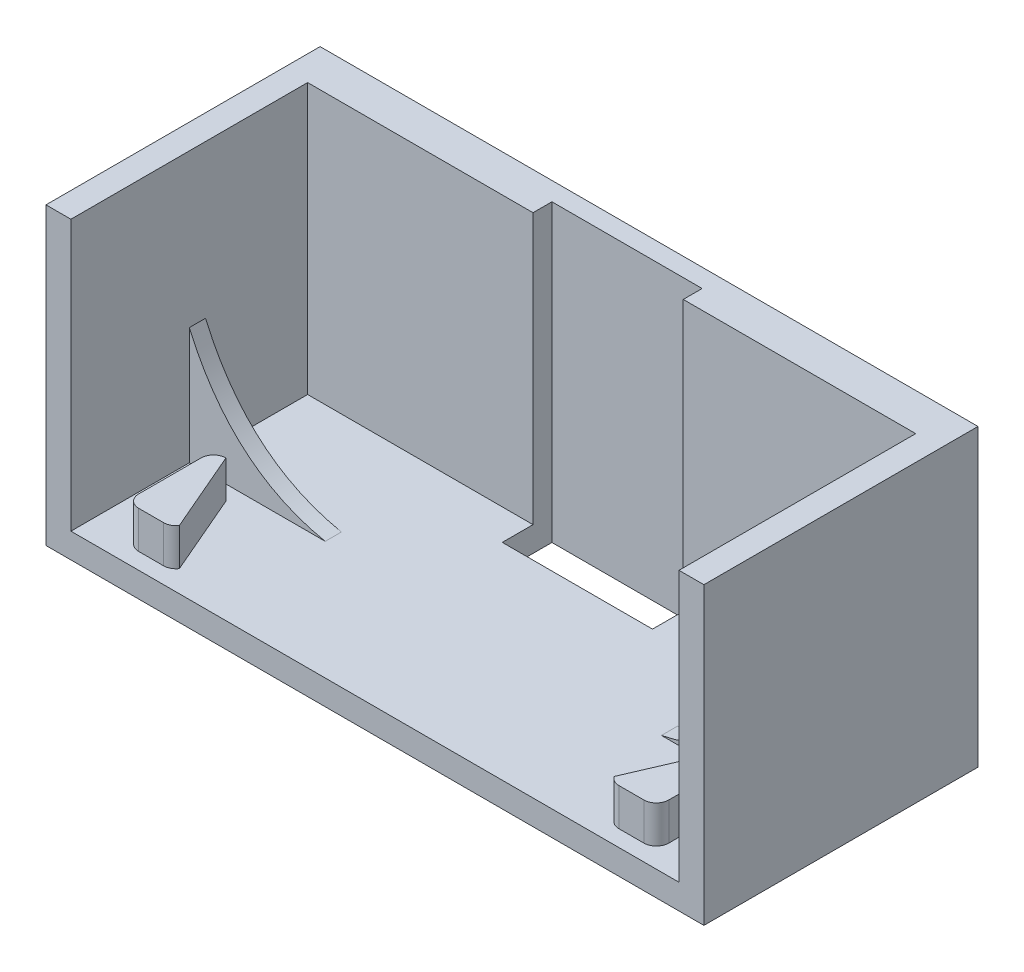
ISO-10303-21;
HEADER;
FILE_DESCRIPTION(('STEP AP214'),'2;1');
FILE_NAME('part.step','',(''),(''),'','','');
FILE_SCHEMA(('AUTOMOTIVE_DESIGN { 1 0 10303 214 1 1 1 1 }'));
ENDSEC;
DATA;
#1=APPLICATION_CONTEXT('core data for automotive mechanical design processes');
#2=APPLICATION_PROTOCOL_DEFINITION('international standard','automotive_design',2000,#1);
#3=PRODUCT_CONTEXT('',#1,'mechanical');
#4=PRODUCT('Part','Part','',(#3));
#5=PRODUCT_RELATED_PRODUCT_CATEGORY('part','',(#4));
#6=PRODUCT_DEFINITION_FORMATION('','',#4);
#7=PRODUCT_DEFINITION_CONTEXT('part definition',#1,'design');
#8=PRODUCT_DEFINITION('design','',#6,#7);
#9=PRODUCT_DEFINITION_SHAPE('','',#8);
#10=(LENGTH_UNIT() NAMED_UNIT(*) SI_UNIT(.MILLI.,.METRE.));
#11=(NAMED_UNIT(*) PLANE_ANGLE_UNIT() SI_UNIT($,.RADIAN.));
#12=(NAMED_UNIT(*) SI_UNIT($,.STERADIAN.) SOLID_ANGLE_UNIT());
#13=UNCERTAINTY_MEASURE_WITH_UNIT(LENGTH_MEASURE(1.E-05),#10,'distance_accuracy_value','');
#14=(GEOMETRIC_REPRESENTATION_CONTEXT(3) GLOBAL_UNCERTAINTY_ASSIGNED_CONTEXT((#13)) GLOBAL_UNIT_ASSIGNED_CONTEXT((#10,
#11,#12)) REPRESENTATION_CONTEXT('',''));
#15=CARTESIAN_POINT('',(0.,0.,0.));
#16=DIRECTION('',(0.,0.,1.));
#17=DIRECTION('',(1.,0.,0.));
#18=AXIS2_PLACEMENT_3D('',#15,#16,#17);
#19=CARTESIAN_POINT('',(-24.404047634165,-1.28478141343808,-19.));
#20=DIRECTION('',(0.,1.,0.));
#21=DIRECTION('',(0.,0.,1.));
#22=AXIS2_PLACEMENT_3D('',#19,#20,#21);
#23=PLANE('',#22);
#24=DIRECTION('',(-1.,0.,0.));
#25=VECTOR('',#24,1.);
#26=CARTESIAN_POINT('',(-24.404047634165,-1.28478141343808,-10.8));
#27=LINE('',#26,#25);
#28=CARTESIAN_POINT('',(-13.4912136586936,-1.28478141343808,-10.8));
#29=VERTEX_POINT('',#28);
#30=CARTESIAN_POINT('',(-24.404047634165,-1.28478141343808,-10.8));
#31=VERTEX_POINT('',#30);
#32=EDGE_CURVE('E647',#29,#31,#27,.T.);
#33=ORIENTED_EDGE('',*,*,#32,.F.);
#34=DIRECTION('',(0.,0.,1.));
#35=VECTOR('',#34,1.);
#36=CARTESIAN_POINT('',(-13.4912136586936,-1.28478141343808,-10.8));
#37=LINE('',#36,#35);
#38=CARTESIAN_POINT('',(-13.4912136586936,-1.28478141343808,-9.5));
#39=VERTEX_POINT('',#38);
#40=EDGE_CURVE('E267',#29,#39,#37,.T.);
#41=ORIENTED_EDGE('',*,*,#40,.T.);
#42=DIRECTION('',(-1.,0.,0.));
#43=VECTOR('',#42,1.);
#44=CARTESIAN_POINT('',(-24.404047634165,-1.28478141343808,-9.5));
#45=LINE('',#44,#43);
#46=CARTESIAN_POINT('',(-24.404047634165,-1.28478141343808,-9.5));
#47=VERTEX_POINT('',#46);
#48=EDGE_CURVE('E254',#39,#47,#45,.T.);
#49=ORIENTED_EDGE('',*,*,#48,.T.);
#50=DIRECTION('',(0.,0.,1.));
#51=VECTOR('',#50,1.);
#52=CARTESIAN_POINT('',(-24.404047634165,-1.28478141343808,-19.));
#53=LINE('',#52,#51);
#54=CARTESIAN_POINT('',(-24.404047634165,-1.28478141343808,0.));
#55=VERTEX_POINT('',#54);
#56=EDGE_CURVE('E264',#47,#55,#53,.T.);
#57=ORIENTED_EDGE('',*,*,#56,.T.);
#58=DIRECTION('',(-1.,0.,0.));
#59=VECTOR('',#58,1.);
#60=CARTESIAN_POINT('',(-24.404047634165,-1.28478141343808,0.));
#61=LINE('',#60,#59);
#62=CARTESIAN_POINT('',(24.404047634165,-1.28478141343808,0.));
#63=VERTEX_POINT('',#62);
#64=EDGE_CURVE('E319',#63,#55,#61,.T.);
#65=ORIENTED_EDGE('',*,*,#64,.F.);
#66=DIRECTION('',(0.,0.,1.));
#67=VECTOR('',#66,1.);
#68=CARTESIAN_POINT('',(24.404047634165,-1.28478141343808,-19.));
#69=LINE('',#68,#67);
#70=CARTESIAN_POINT('',(24.404047634165,-1.28478141343808,-9.5));
#71=VERTEX_POINT('',#70);
#72=EDGE_CURVE('E281',#71,#63,#69,.T.);
#73=ORIENTED_EDGE('',*,*,#72,.F.);
#74=DIRECTION('',(-1.,0.,0.));
#75=VECTOR('',#74,1.);
#76=CARTESIAN_POINT('',(24.404047634165,-1.28478141343809,-9.5));
#77=LINE('',#76,#75);
#78=CARTESIAN_POINT('',(13.4912136586936,-1.28478141343808,-9.5));
#79=VERTEX_POINT('',#78);
#80=EDGE_CURVE('E490',#71,#79,#77,.T.);
#81=ORIENTED_EDGE('',*,*,#80,.T.);
#82=DIRECTION('',(0.,0.,1.));
#83=VECTOR('',#82,1.);
#84=CARTESIAN_POINT('',(13.4912136586936,-1.28478141343809,-10.8));
#85=LINE('',#84,#83);
#86=CARTESIAN_POINT('',(13.4912136586936,-1.28478141343809,-10.8));
#87=VERTEX_POINT('',#86);
#88=EDGE_CURVE('E66',#87,#79,#85,.T.);
#89=ORIENTED_EDGE('',*,*,#88,.F.);
#90=DIRECTION('',(-1.,0.,0.));
#91=VECTOR('',#90,1.);
#92=CARTESIAN_POINT('',(24.404047634165,-1.28478141343809,-10.8));
#93=LINE('',#92,#91);
#94=CARTESIAN_POINT('',(24.404047634165,-1.28478141343808,-10.8));
#95=VERTEX_POINT('',#94);
#96=EDGE_CURVE('E501',#95,#87,#93,.T.);
#97=ORIENTED_EDGE('',*,*,#96,.F.);
#98=CARTESIAN_POINT('',(24.404047634165,-1.28478141343808,-19.));
#99=VERTEX_POINT('',#98);
#100=EDGE_CURVE('E276',#99,#95,#69,.T.);
#101=ORIENTED_EDGE('',*,*,#100,.F.);
#102=DIRECTION('',(-1.,0.,0.));
#103=VECTOR('',#102,1.);
#104=CARTESIAN_POINT('',(-24.404047634165,-1.28478141343808,-19.));
#105=LINE('',#104,#103);
#106=CARTESIAN_POINT('',(5.74495861203088,-1.28478141343808,-19.));
#107=VERTEX_POINT('',#106);
#108=EDGE_CURVE('E339',#99,#107,#105,.T.);
#109=ORIENTED_EDGE('',*,*,#108,.T.);
#110=DIRECTION('',(0.,0.,-1.));
#111=VECTOR('',#110,1.);
#112=CARTESIAN_POINT('',(5.74495861203088,-1.28478141343808,-19.));
#113=LINE('',#112,#111);
#114=CARTESIAN_POINT('',(5.74495861203088,-1.28478141343808,-16.5331474449164));
#115=VERTEX_POINT('',#114);
#116=EDGE_CURVE('E360',#115,#107,#113,.T.);
#117=ORIENTED_EDGE('',*,*,#116,.F.);
#118=DIRECTION('',(1.,0.,0.));
#119=VECTOR('',#118,1.);
#120=CARTESIAN_POINT('',(-24.404047634165,-1.28478141343808,-16.5331474449164));
#121=LINE('',#120,#119);
#122=CARTESIAN_POINT('',(-6.31294046898743,-1.28478141343808,-16.5331474449164));
#123=VERTEX_POINT('',#122);
#124=EDGE_CURVE('E358',#123,#115,#121,.T.);
#125=ORIENTED_EDGE('',*,*,#124,.F.);
#126=DIRECTION('',(0.,0.,1.));
#127=VECTOR('',#126,1.);
#128=CARTESIAN_POINT('',(-6.31294046898743,-1.28478141343808,-19.));
#129=LINE('',#128,#127);
#130=CARTESIAN_POINT('',(-6.31294046898743,-1.28478141343808,-19.));
#131=VERTEX_POINT('',#130);
#132=EDGE_CURVE('E364',#131,#123,#129,.T.);
#133=ORIENTED_EDGE('',*,*,#132,.F.);
#134=CARTESIAN_POINT('',(-24.404047634165,-1.28478141343808,-19.));
#135=VERTEX_POINT('',#134);
#136=EDGE_CURVE('E322',#131,#135,#105,.T.);
#137=ORIENTED_EDGE('',*,*,#136,.T.);
#138=EDGE_CURVE('E275',#135,#31,#53,.T.);
#139=ORIENTED_EDGE('',*,*,#138,.T.);
#140=EDGE_LOOP('',(#33,#41,#49,#57,#65,#73,#81,#89,#97,#101,#109,#117,#125,#133,#137,#139));
#141=FACE_BOUND('',#140,.T.);
#142=CARTESIAN_POINT('',(20.2732064728308,-1.28478141343808,-7.31155693715636));
#143=DIRECTION('',(0.,1.,0.));
#144=DIRECTION('',(0.,0.,1.));
#145=AXIS2_PLACEMENT_3D('',#142,#143,#144);
#146=CIRCLE('',#145,1.00000000000007);
#147=CARTESIAN_POINT('',(20.2732064728308,-1.28478141343808,-8.31155693715643));
#148=VERTEX_POINT('',#147);
#149=CARTESIAN_POINT('',(21.2732064728308,-1.28478141343808,-7.31155693715633));
#150=VERTEX_POINT('',#149);
#151=EDGE_CURVE('E463',#148,#150,#146,.F.);
#152=ORIENTED_EDGE('',*,*,#151,.T.);
#153=DIRECTION('',(0.,0.,1.));
#154=VECTOR('',#153,1.);
#155=CARTESIAN_POINT('',(21.2732064728308,-1.28478141343808,0.));
#156=LINE('',#155,#154);
#157=CARTESIAN_POINT('',(21.2732064728308,-1.28478141343808,-2.31155693715638));
#158=VERTEX_POINT('',#157);
#159=EDGE_CURVE('E451',#150,#158,#156,.T.);
#160=ORIENTED_EDGE('',*,*,#159,.T.);
#161=CARTESIAN_POINT('',(20.2732064728308,-1.28478141343808,-2.31155693715636));
#162=DIRECTION('',(0.,1.,0.));
#163=DIRECTION('',(0.,0.,1.));
#164=AXIS2_PLACEMENT_3D('',#161,#162,#163);
#165=CIRCLE('',#164,1.00000000000007);
#166=CARTESIAN_POINT('',(20.2732064728308,-1.28478141343808,-1.31155693715628));
#167=VERTEX_POINT('',#166);
#168=EDGE_CURVE('E454',#158,#167,#165,.F.);
#169=ORIENTED_EDGE('',*,*,#168,.T.);
#170=DIRECTION('',(-1.,0.,0.));
#171=VECTOR('',#170,1.);
#172=CARTESIAN_POINT('',(0.,-1.28478141343808,-1.31155693715776));
#173=LINE('',#172,#171);
#174=CARTESIAN_POINT('',(18.2732064728308,-1.28478141343808,-1.31155693715643));
#175=VERTEX_POINT('',#174);
#176=EDGE_CURVE('E456',#167,#175,#173,.T.);
#177=ORIENTED_EDGE('',*,*,#176,.T.);
#178=CARTESIAN_POINT('',(18.2732064728308,-1.28478141343808,-2.31155693715636));
#179=DIRECTION('',(0.,1.,0.));
#180=DIRECTION('',(0.,0.,1.));
#181=AXIS2_PLACEMENT_3D('',#178,#179,#180);
#182=CIRCLE('',#181,0.999999999999928);
#183=CARTESIAN_POINT('',(17.4471913691403,-1.28478141343808,-1.74790895439137));
#184=VERTEX_POINT('',#183);
#185=EDGE_CURVE('E458',#175,#184,#182,.F.);
#186=ORIENTED_EDGE('',*,*,#185,.T.);
#187=DIRECTION('',(-0.39545835021334,0.,0.918483910172924));
#188=VECTOR('',#187,1.);
#189=CARTESIAN_POINT('',(14.0837928838766,-1.28478141343808,6.06385526944684));
#190=LINE('',#189,#188);
#191=EDGE_CURVE('E460',#148,#184,#190,.T.);
#192=ORIENTED_EDGE('',*,*,#191,.F.);
#193=EDGE_LOOP('',(#152,#160,#169,#177,#186,#192));
#194=FACE_BOUND('',#193,.T.);
#195=CARTESIAN_POINT('',(-18.2732064728308,-1.28478141343808,-2.31155693715636));
#196=DIRECTION('',(0.,1.,0.));
#197=DIRECTION('',(0.,0.,1.));
#198=AXIS2_PLACEMENT_3D('',#195,#196,#197);
#199=CIRCLE('',#198,0.999999999999928);
#200=CARTESIAN_POINT('',(-18.2732064728308,-1.28478141343808,-1.31155693715643));
#201=VERTEX_POINT('',#200);
#202=CARTESIAN_POINT('',(-17.4471913691403,-1.28478141343808,-1.74790895439137));
#203=VERTEX_POINT('',#202);
#204=EDGE_CURVE('E414',#201,#203,#199,.T.);
#205=ORIENTED_EDGE('',*,*,#204,.F.);
#206=DIRECTION('',(1.,0.,0.));
#207=VECTOR('',#206,1.);
#208=CARTESIAN_POINT('',(0.,-1.28478141343808,-1.31155693715776));
#209=LINE('',#208,#207);
#210=CARTESIAN_POINT('',(-20.2732064728308,-1.28478141343808,-1.31155693715628));
#211=VERTEX_POINT('',#210);
#212=EDGE_CURVE('E417',#211,#201,#209,.T.);
#213=ORIENTED_EDGE('',*,*,#212,.F.);
#214=CARTESIAN_POINT('',(-20.2732064728308,-1.28478141343808,-2.31155693715636));
#215=DIRECTION('',(0.,1.,0.));
#216=DIRECTION('',(0.,0.,1.));
#217=AXIS2_PLACEMENT_3D('',#214,#215,#216);
#218=CIRCLE('',#217,1.00000000000007);
#219=CARTESIAN_POINT('',(-21.2732064728308,-1.28478141343808,-2.31155693715638));
#220=VERTEX_POINT('',#219);
#221=EDGE_CURVE('E403',#220,#211,#218,.T.);
#222=ORIENTED_EDGE('',*,*,#221,.F.);
#223=DIRECTION('',(0.,0.,1.));
#224=VECTOR('',#223,1.);
#225=CARTESIAN_POINT('',(-21.2732064728308,-1.28478141343808,0.));
#226=LINE('',#225,#224);
#227=CARTESIAN_POINT('',(-21.2732064728308,-1.28478141343808,-7.31155693715633));
#228=VERTEX_POINT('',#227);
#229=EDGE_CURVE('E406',#228,#220,#226,.T.);
#230=ORIENTED_EDGE('',*,*,#229,.F.);
#231=CARTESIAN_POINT('',(-20.2732064728308,-1.28478141343808,-7.31155693715636));
#232=DIRECTION('',(0.,1.,0.));
#233=DIRECTION('',(0.,0.,1.));
#234=AXIS2_PLACEMENT_3D('',#231,#232,#233);
#235=CIRCLE('',#234,1.00000000000007);
#236=CARTESIAN_POINT('',(-20.2732064728308,-1.28478141343808,-8.31155693715643));
#237=VERTEX_POINT('',#236);
#238=EDGE_CURVE('E409',#237,#228,#235,.T.);
#239=ORIENTED_EDGE('',*,*,#238,.F.);
#240=DIRECTION('',(0.39545835021334,0.,0.918483910172924));
#241=VECTOR('',#240,1.);
#242=CARTESIAN_POINT('',(-14.0837928838766,-1.28478141343808,6.06385526944684));
#243=LINE('',#242,#241);
#244=EDGE_CURVE('E411',#237,#203,#243,.T.);
#245=ORIENTED_EDGE('',*,*,#244,.T.);
#246=EDGE_LOOP('',(#205,#213,#222,#230,#239,#245));
#247=FACE_BOUND('',#246,.T.);
#248=ADVANCED_FACE('F43',(#141,#194,#247),#23,.T.);
#249=CARTESIAN_POINT('',(24.404047634165,-1.28478141343808,-19.));
#250=DIRECTION('',(-1.,0.,0.));
#251=DIRECTION('',(0.,0.,1.));
#252=AXIS2_PLACEMENT_3D('',#249,#250,#251);
#253=PLANE('',#252);
#254=ORIENTED_EDGE('',*,*,#100,.T.);
#255=DIRECTION('',(0.,-1.,0.));
#256=VECTOR('',#255,1.);
#257=CARTESIAN_POINT('',(24.404047634165,-1.28478141343809,-10.8));
#258=LINE('',#257,#256);
#259=CARTESIAN_POINT('',(24.404047634165,8.11498205680096,-10.8));
#260=VERTEX_POINT('',#259);
#261=EDGE_CURVE('E489',#260,#95,#258,.T.);
#262=ORIENTED_EDGE('',*,*,#261,.F.);
#263=DIRECTION('',(0.,0.,1.));
#264=VECTOR('',#263,1.);
#265=CARTESIAN_POINT('',(24.404047634165,8.11498205680096,-10.8));
#266=LINE('',#265,#264);
#267=CARTESIAN_POINT('',(24.404047634165,8.11498205680096,-9.5));
#268=VERTEX_POINT('',#267);
#269=EDGE_CURVE('E481',#260,#268,#266,.T.);
#270=ORIENTED_EDGE('',*,*,#269,.T.);
#271=DIRECTION('',(0.,-1.,0.));
#272=VECTOR('',#271,1.);
#273=CARTESIAN_POINT('',(24.404047634165,-1.28478141343809,-9.5));
#274=LINE('',#273,#272);
#275=EDGE_CURVE('E259',#268,#71,#274,.T.);
#276=ORIENTED_EDGE('',*,*,#275,.T.);
#277=ORIENTED_EDGE('',*,*,#72,.T.);
#278=DIRECTION('',(0.,-1.,0.));
#279=VECTOR('',#278,1.);
#280=CARTESIAN_POINT('',(24.404047634165,-1.28478141343808,0.));
#281=LINE('',#280,#279);
#282=CARTESIAN_POINT('',(24.404047634165,20.4,0.));
#283=VERTEX_POINT('',#282);
#284=EDGE_CURVE('E324',#283,#63,#281,.T.);
#285=ORIENTED_EDGE('',*,*,#284,.F.);
#286=DIRECTION('',(0.,0.,1.));
#287=VECTOR('',#286,1.);
#288=CARTESIAN_POINT('',(24.404047634165,20.4,-19.));
#289=LINE('',#288,#287);
#290=CARTESIAN_POINT('',(24.404047634165,20.4,-19.));
#291=VERTEX_POINT('',#290);
#292=EDGE_CURVE('E286',#291,#283,#289,.T.);
#293=ORIENTED_EDGE('',*,*,#292,.F.);
#294=DIRECTION('',(0.,-1.,0.));
#295=VECTOR('',#294,1.);
#296=CARTESIAN_POINT('',(24.404047634165,-1.28478141343808,-19.));
#297=LINE('',#296,#295);
#298=EDGE_CURVE('E320',#291,#99,#297,.T.);
#299=ORIENTED_EDGE('',*,*,#298,.T.);
#300=EDGE_LOOP('',(#254,#262,#270,#276,#277,#285,#293,#299));
#301=FACE_BOUND('',#300,.T.);
#302=ADVANCED_FACE('F601',(#301),#253,.T.);
#303=CARTESIAN_POINT('',(0.,0.,-19.));
#304=DIRECTION('',(0.,0.,1.));
#305=DIRECTION('',(1.,0.,0.));
#306=AXIS2_PLACEMENT_3D('',#303,#304,#305);
#307=PLANE('',#306);
#308=DIRECTION('',(0.,1.,0.));
#309=VECTOR('',#308,1.);
#310=CARTESIAN_POINT('',(5.74495861203088,0.,-19.));
#311=LINE('',#310,#309);
#312=CARTESIAN_POINT('',(5.74495861203088,20.4,-19.));
#313=VERTEX_POINT('',#312);
#314=EDGE_CURVE('E11',#107,#313,#311,.T.);
#315=ORIENTED_EDGE('',*,*,#314,.F.);
#316=ORIENTED_EDGE('',*,*,#108,.F.);
#317=ORIENTED_EDGE('',*,*,#298,.F.);
#318=DIRECTION('',(1.,0.,0.));
#319=VECTOR('',#318,1.);
#320=CARTESIAN_POINT('',(26.404047634165,20.4,-19.));
#321=LINE('',#320,#319);
#322=EDGE_CURVE('E345',#313,#291,#321,.T.);
#323=ORIENTED_EDGE('',*,*,#322,.F.);
#324=EDGE_LOOP('',(#315,#316,#317,#323));
#325=FACE_BOUND('',#324,.T.);
#326=ADVANCED_FACE('F594',(#325),#307,.T.);
#327=CARTESIAN_POINT('',(-24.404047634165,20.4,-19.));
#328=DIRECTION('',(1.,0.,0.));
#329=DIRECTION('',(0.,0.,-1.));
#330=AXIS2_PLACEMENT_3D('',#327,#328,#329);
#331=PLANE('',#330);
#332=DIRECTION('',(0.,1.,0.));
#333=VECTOR('',#332,1.);
#334=CARTESIAN_POINT('',(-24.404047634165,-1.28478141343808,-10.8));
#335=LINE('',#334,#333);
#336=CARTESIAN_POINT('',(-24.404047634165,8.11498205680097,-10.8));
#337=VERTEX_POINT('',#336);
#338=EDGE_CURVE('E268',#31,#337,#335,.T.);
#339=ORIENTED_EDGE('',*,*,#338,.F.);
#340=ORIENTED_EDGE('',*,*,#138,.F.);
#341=DIRECTION('',(0.,1.,0.));
#342=VECTOR('',#341,1.);
#343=CARTESIAN_POINT('',(-24.404047634165,20.4,-19.));
#344=LINE('',#343,#342);
#345=CARTESIAN_POINT('',(-24.404047634165,20.4,-19.));
#346=VERTEX_POINT('',#345);
#347=EDGE_CURVE('E295',#135,#346,#344,.T.);
#348=ORIENTED_EDGE('',*,*,#347,.T.);
#349=DIRECTION('',(0.,0.,1.));
#350=VECTOR('',#349,1.);
#351=CARTESIAN_POINT('',(-24.404047634165,20.4,-19.));
#352=LINE('',#351,#350);
#353=CARTESIAN_POINT('',(-24.404047634165,20.4,0.));
#354=VERTEX_POINT('',#353);
#355=EDGE_CURVE('E279',#346,#354,#352,.T.);
#356=ORIENTED_EDGE('',*,*,#355,.T.);
#357=DIRECTION('',(0.,1.,0.));
#358=VECTOR('',#357,1.);
#359=CARTESIAN_POINT('',(-24.404047634165,20.4,0.));
#360=LINE('',#359,#358);
#361=EDGE_CURVE('E274',#55,#354,#360,.T.);
#362=ORIENTED_EDGE('',*,*,#361,.F.);
#363=ORIENTED_EDGE('',*,*,#56,.F.);
#364=DIRECTION('',(0.,1.,0.));
#365=VECTOR('',#364,1.);
#366=CARTESIAN_POINT('',(-24.404047634165,-1.28478141343808,-9.5));
#367=LINE('',#366,#365);
#368=CARTESIAN_POINT('',(-24.404047634165,8.11498205680097,-9.5));
#369=VERTEX_POINT('',#368);
#370=EDGE_CURVE('E251',#47,#369,#367,.T.);
#371=ORIENTED_EDGE('',*,*,#370,.T.);
#372=DIRECTION('',(0.,0.,1.));
#373=VECTOR('',#372,1.);
#374=CARTESIAN_POINT('',(-24.404047634165,8.11498205680097,-10.8));
#375=LINE('',#374,#373);
#376=EDGE_CURVE('E58',#337,#369,#375,.T.);
#377=ORIENTED_EDGE('',*,*,#376,.F.);
#378=EDGE_LOOP('',(#339,#340,#348,#356,#362,#363,#371,#377));
#379=FACE_BOUND('',#378,.T.);
#380=ADVANCED_FACE('F272',(#379),#331,.T.);
#381=CARTESIAN_POINT('',(26.404047634165,20.4,-19.));
#382=DIRECTION('',(0.,1.,0.));
#383=DIRECTION('',(0.,0.,1.));
#384=AXIS2_PLACEMENT_3D('',#381,#382,#383);
#385=PLANE('',#384);
#386=DIRECTION('',(0.,0.,-1.));
#387=VECTOR('',#386,1.);
#388=CARTESIAN_POINT('',(5.74495861203088,20.4,-19.));
#389=LINE('',#388,#387);
#390=CARTESIAN_POINT('',(5.74495861203088,20.4,-20.5174967064703));
#391=VERTEX_POINT('',#390);
#392=EDGE_CURVE('E362',#313,#391,#389,.T.);
#393=ORIENTED_EDGE('',*,*,#392,.F.);
#394=ORIENTED_EDGE('',*,*,#322,.T.);
#395=ORIENTED_EDGE('',*,*,#292,.T.);
#396=DIRECTION('',(-1.,0.,0.));
#397=VECTOR('',#396,1.);
#398=CARTESIAN_POINT('',(26.404047634165,20.4,0.));
#399=LINE('',#398,#397);
#400=CARTESIAN_POINT('',(26.404047634165,20.4,0.));
#401=VERTEX_POINT('',#400);
#402=EDGE_CURVE('E328',#401,#283,#399,.T.);
#403=ORIENTED_EDGE('',*,*,#402,.F.);
#404=DIRECTION('',(0.,0.,1.));
#405=VECTOR('',#404,1.);
#406=CARTESIAN_POINT('',(26.404047634165,20.4,-19.));
#407=LINE('',#406,#405);
#408=CARTESIAN_POINT('',(26.404047634165,20.4,-22.));
#409=VERTEX_POINT('',#408);
#410=EDGE_CURVE('E288',#409,#401,#407,.T.);
#411=ORIENTED_EDGE('',*,*,#410,.F.);
#412=DIRECTION('',(1.,0.,0.));
#413=VECTOR('',#412,1.);
#414=CARTESIAN_POINT('',(26.404047634165,20.4,-22.));
#415=LINE('',#414,#413);
#416=CARTESIAN_POINT('',(-26.404047634165,20.4,-22.));
#417=VERTEX_POINT('',#416);
#418=EDGE_CURVE('E315',#417,#409,#415,.T.);
#419=ORIENTED_EDGE('',*,*,#418,.F.);
#420=DIRECTION('',(0.,0.,1.));
#421=VECTOR('',#420,1.);
#422=CARTESIAN_POINT('',(-26.404047634165,20.4,-19.));
#423=LINE('',#422,#421);
#424=CARTESIAN_POINT('',(-26.404047634165,20.4,0.));
#425=VERTEX_POINT('',#424);
#426=EDGE_CURVE('E294',#417,#425,#423,.T.);
#427=ORIENTED_EDGE('',*,*,#426,.T.);
#428=DIRECTION('',(-1.,0.,0.));
#429=VECTOR('',#428,1.);
#430=CARTESIAN_POINT('',(-26.404047634165,20.4,0.));
#431=LINE('',#430,#429);
#432=EDGE_CURVE('E307',#354,#425,#431,.T.);
#433=ORIENTED_EDGE('',*,*,#432,.F.);
#434=ORIENTED_EDGE('',*,*,#355,.F.);
#435=CARTESIAN_POINT('',(-6.31294046898741,20.4,-19.));
#436=VERTEX_POINT('',#435);
#437=EDGE_CURVE('E342',#346,#436,#321,.T.);
#438=ORIENTED_EDGE('',*,*,#437,.T.);
#439=DIRECTION('',(0.,0.,1.));
#440=VECTOR('',#439,1.);
#441=CARTESIAN_POINT('',(-6.31294046898743,20.4,-19.));
#442=LINE('',#441,#440);
#443=CARTESIAN_POINT('',(-6.31294046898743,20.4,-20.5174967064703));
#444=VERTEX_POINT('',#443);
#445=EDGE_CURVE('E366',#444,#436,#442,.T.);
#446=ORIENTED_EDGE('',*,*,#445,.F.);
#447=DIRECTION('',(-1.,0.,0.));
#448=VECTOR('',#447,1.);
#449=CARTESIAN_POINT('',(26.404047634165,20.4,-20.5174967064703));
#450=LINE('',#449,#448);
#451=EDGE_CURVE('E356',#391,#444,#450,.T.);
#452=ORIENTED_EDGE('',*,*,#451,.F.);
#453=EDGE_LOOP('',(#393,#394,#395,#403,#411,#419,#427,#433,#434,#438,#446,#452));
#454=FACE_BOUND('',#453,.T.);
#455=ADVANCED_FACE('F309',(#454),#385,.T.);
#456=CARTESIAN_POINT('',(26.404047634165,-3.28478141343808,-19.));
#457=DIRECTION('',(1.,0.,0.));
#458=DIRECTION('',(0.,0.,-1.));
#459=AXIS2_PLACEMENT_3D('',#456,#457,#458);
#460=PLANE('',#459);
#461=DIRECTION('',(0.,1.,0.));
#462=VECTOR('',#461,1.);
#463=CARTESIAN_POINT('',(26.404047634165,-3.28478141343808,0.));
#464=LINE('',#463,#462);
#465=CARTESIAN_POINT('',(26.404047634165,-3.28478141343808,0.));
#466=VERTEX_POINT('',#465);
#467=EDGE_CURVE('E331',#466,#401,#464,.T.);
#468=ORIENTED_EDGE('',*,*,#467,.F.);
#469=DIRECTION('',(0.,0.,1.));
#470=VECTOR('',#469,1.);
#471=CARTESIAN_POINT('',(26.404047634165,-3.28478141343808,-19.));
#472=LINE('',#471,#470);
#473=CARTESIAN_POINT('',(26.404047634165,-3.28478141343808,-22.));
#474=VERTEX_POINT('',#473);
#475=EDGE_CURVE('E290',#474,#466,#472,.T.);
#476=ORIENTED_EDGE('',*,*,#475,.F.);
#477=DIRECTION('',(0.,-1.,0.));
#478=VECTOR('',#477,1.);
#479=CARTESIAN_POINT('',(26.404047634165,-3.28478141343808,-22.));
#480=LINE('',#479,#478);
#481=EDGE_CURVE('E344',#409,#474,#480,.T.);
#482=ORIENTED_EDGE('',*,*,#481,.F.);
#483=ORIENTED_EDGE('',*,*,#410,.T.);
#484=EDGE_LOOP('',(#468,#476,#482,#483));
#485=FACE_BOUND('',#484,.T.);
#486=ADVANCED_FACE('F607',(#485),#460,.T.);
#487=CARTESIAN_POINT('',(-26.404047634165,-3.28478141343808,-19.));
#488=DIRECTION('',(0.,-1.,0.));
#489=DIRECTION('',(1.,0.,0.));
#490=AXIS2_PLACEMENT_3D('',#487,#488,#489);
#491=PLANE('',#490);
#492=DIRECTION('',(0.,0.,1.));
#493=VECTOR('',#492,1.);
#494=CARTESIAN_POINT('',(5.74495861203088,-3.28478141343808,-16.5331474449164));
#495=LINE('',#494,#493);
#496=CARTESIAN_POINT('',(5.74495861203088,-3.28478141343808,-20.5174967064703));
#497=VERTEX_POINT('',#496);
#498=CARTESIAN_POINT('',(5.74495861203088,-3.28478141343808,-16.5331474449164));
#499=VERTEX_POINT('',#498);
#500=EDGE_CURVE('E386',#497,#499,#495,.T.);
#501=ORIENTED_EDGE('',*,*,#500,.F.);
#502=DIRECTION('',(1.,0.,0.));
#503=VECTOR('',#502,1.);
#504=CARTESIAN_POINT('',(5.74495861203088,-3.28478141343808,-20.5174967064703));
#505=LINE('',#504,#503);
#506=CARTESIAN_POINT('',(-6.31294046898743,-3.28478141343808,-20.5174967064703));
#507=VERTEX_POINT('',#506);
#508=EDGE_CURVE('E373',#507,#497,#505,.T.);
#509=ORIENTED_EDGE('',*,*,#508,.F.);
#510=DIRECTION('',(0.,0.,-1.));
#511=VECTOR('',#510,1.);
#512=CARTESIAN_POINT('',(-6.31294046898743,-3.28478141343808,-16.5331474449164));
#513=LINE('',#512,#511);
#514=CARTESIAN_POINT('',(-6.31294046898743,-3.28478141343808,-16.5331474449164));
#515=VERTEX_POINT('',#514);
#516=EDGE_CURVE('E380',#515,#507,#513,.T.);
#517=ORIENTED_EDGE('',*,*,#516,.F.);
#518=DIRECTION('',(-1.,0.,0.));
#519=VECTOR('',#518,1.);
#520=CARTESIAN_POINT('',(5.74495861203088,-3.28478141343808,-16.5331474449164));
#521=LINE('',#520,#519);
#522=EDGE_CURVE('E383',#499,#515,#521,.T.);
#523=ORIENTED_EDGE('',*,*,#522,.F.);
#524=EDGE_LOOP('',(#501,#509,#517,#523));
#525=FACE_BOUND('',#524,.T.);
#526=DIRECTION('',(1.,0.,0.));
#527=VECTOR('',#526,1.);
#528=CARTESIAN_POINT('',(-26.404047634165,-3.28478141343808,0.));
#529=LINE('',#528,#527);
#530=CARTESIAN_POINT('',(-26.404047634165,-3.28478141343808,0.));
#531=VERTEX_POINT('',#530);
#532=EDGE_CURVE('E334',#531,#466,#529,.T.);
#533=ORIENTED_EDGE('',*,*,#532,.F.);
#534=DIRECTION('',(0.,0.,1.));
#535=VECTOR('',#534,1.);
#536=CARTESIAN_POINT('',(-26.404047634165,-3.28478141343808,-19.));
#537=LINE('',#536,#535);
#538=CARTESIAN_POINT('',(-26.404047634165,-3.28478141343808,-22.));
#539=VERTEX_POINT('',#538);
#540=EDGE_CURVE('E292',#539,#531,#537,.T.);
#541=ORIENTED_EDGE('',*,*,#540,.F.);
#542=DIRECTION('',(-1.,0.,0.));
#543=VECTOR('',#542,1.);
#544=CARTESIAN_POINT('',(26.404047634165,-3.28478141343808,-22.));
#545=LINE('',#544,#543);
#546=EDGE_CURVE('E351',#474,#539,#545,.T.);
#547=ORIENTED_EDGE('',*,*,#546,.F.);
#548=ORIENTED_EDGE('',*,*,#475,.T.);
#549=EDGE_LOOP('',(#533,#541,#547,#548));
#550=FACE_BOUND('',#549,.T.);
#551=ADVANCED_FACE('F609',(#525,#550),#491,.T.);
#552=CARTESIAN_POINT('',(-26.404047634165,20.4,-19.));
#553=DIRECTION('',(-1.,0.,0.));
#554=DIRECTION('',(0.,0.,1.));
#555=AXIS2_PLACEMENT_3D('',#552,#553,#554);
#556=PLANE('',#555);
#557=DIRECTION('',(0.,-1.,0.));
#558=VECTOR('',#557,1.);
#559=CARTESIAN_POINT('',(-26.404047634165,20.4,0.));
#560=LINE('',#559,#558);
#561=EDGE_CURVE('E314',#425,#531,#560,.T.);
#562=ORIENTED_EDGE('',*,*,#561,.F.);
#563=ORIENTED_EDGE('',*,*,#426,.F.);
#564=DIRECTION('',(0.,1.,0.));
#565=VECTOR('',#564,1.);
#566=CARTESIAN_POINT('',(-26.404047634165,-3.28478141343808,-22.));
#567=LINE('',#566,#565);
#568=EDGE_CURVE('E348',#539,#417,#567,.T.);
#569=ORIENTED_EDGE('',*,*,#568,.F.);
#570=ORIENTED_EDGE('',*,*,#540,.T.);
#571=EDGE_LOOP('',(#562,#563,#569,#570));
#572=FACE_BOUND('',#571,.T.);
#573=ADVANCED_FACE('F45',(#572),#556,.T.);
#574=CARTESIAN_POINT('',(0.,0.,0.));
#575=DIRECTION('',(0.,0.,-1.));
#576=DIRECTION('',(-1.,0.,0.));
#577=AXIS2_PLACEMENT_3D('',#574,#575,#576);
#578=PLANE('',#577);
#579=ORIENTED_EDGE('',*,*,#432,.T.);
#580=ORIENTED_EDGE('',*,*,#561,.T.);
#581=ORIENTED_EDGE('',*,*,#532,.T.);
#582=ORIENTED_EDGE('',*,*,#467,.T.);
#583=ORIENTED_EDGE('',*,*,#402,.T.);
#584=ORIENTED_EDGE('',*,*,#284,.T.);
#585=ORIENTED_EDGE('',*,*,#64,.T.);
#586=ORIENTED_EDGE('',*,*,#361,.T.);
#587=EDGE_LOOP('',(#579,#580,#581,#582,#583,#584,#585,#586));
#588=FACE_BOUND('',#587,.T.);
#589=ADVANCED_FACE('F317',(#588),#578,.F.);
#590=DIRECTION('',(0.,-1.,0.));
#591=VECTOR('',#590,1.);
#592=CARTESIAN_POINT('',(-6.31294046898743,0.,-19.));
#593=LINE('',#592,#591);
#594=EDGE_CURVE('E51',#436,#131,#593,.T.);
#595=ORIENTED_EDGE('',*,*,#594,.F.);
#596=ORIENTED_EDGE('',*,*,#437,.F.);
#597=ORIENTED_EDGE('',*,*,#347,.F.);
#598=ORIENTED_EDGE('',*,*,#136,.F.);
#599=EDGE_LOOP('',(#595,#596,#597,#598));
#600=FACE_BOUND('',#599,.T.);
#601=ADVANCED_FACE('F589',(#600),#307,.T.);
#602=CARTESIAN_POINT('',(0.,0.,-22.));
#603=DIRECTION('',(0.,0.,1.));
#604=DIRECTION('',(1.,0.,0.));
#605=AXIS2_PLACEMENT_3D('',#602,#603,#604);
#606=PLANE('',#605);
#607=ORIENTED_EDGE('',*,*,#481,.T.);
#608=ORIENTED_EDGE('',*,*,#546,.T.);
#609=ORIENTED_EDGE('',*,*,#568,.T.);
#610=ORIENTED_EDGE('',*,*,#418,.T.);
#611=EDGE_LOOP('',(#607,#608,#609,#610));
#612=FACE_BOUND('',#611,.T.);
#613=ADVANCED_FACE('F585',(#612),#606,.F.);
#614=CARTESIAN_POINT('',(5.74495861203088,22.7152185865619,-16.5331474449164));
#615=DIRECTION('',(1.,0.,0.));
#616=DIRECTION('',(0.,1.,0.));
#617=AXIS2_PLACEMENT_3D('',#614,#615,#616);
#618=PLANE('',#617);
#619=ORIENTED_EDGE('',*,*,#116,.T.);
#620=ORIENTED_EDGE('',*,*,#314,.T.);
#621=ORIENTED_EDGE('',*,*,#392,.T.);
#622=DIRECTION('',(0.,-1.,0.));
#623=VECTOR('',#622,1.);
#624=CARTESIAN_POINT('',(5.74495861203088,22.7152185865619,-20.5174967064703));
#625=LINE('',#624,#623);
#626=EDGE_CURVE('E368',#391,#497,#625,.T.);
#627=ORIENTED_EDGE('',*,*,#626,.T.);
#628=ORIENTED_EDGE('',*,*,#500,.T.);
#629=DIRECTION('',(0.,-1.,0.));
#630=VECTOR('',#629,1.);
#631=CARTESIAN_POINT('',(5.74495861203088,22.7152185865619,-16.5331474449164));
#632=LINE('',#631,#630);
#633=EDGE_CURVE('E369',#115,#499,#632,.T.);
#634=ORIENTED_EDGE('',*,*,#633,.F.);
#635=EDGE_LOOP('',(#619,#620,#621,#627,#628,#634));
#636=FACE_BOUND('',#635,.T.);
#637=ADVANCED_FACE('F576',(#636),#618,.F.);
#638=CARTESIAN_POINT('',(5.74495861203088,22.7152185865619,-20.5174967064703));
#639=DIRECTION('',(0.,0.,-1.));
#640=DIRECTION('',(-1.,0.,0.));
#641=AXIS2_PLACEMENT_3D('',#638,#639,#640);
#642=PLANE('',#641);
#643=ORIENTED_EDGE('',*,*,#451,.T.);
#644=DIRECTION('',(0.,-1.,0.));
#645=VECTOR('',#644,1.);
#646=CARTESIAN_POINT('',(-6.31294046898743,22.7152185865619,-20.5174967064703));
#647=LINE('',#646,#645);
#648=EDGE_CURVE('E375',#444,#507,#647,.T.);
#649=ORIENTED_EDGE('',*,*,#648,.T.);
#650=ORIENTED_EDGE('',*,*,#508,.T.);
#651=ORIENTED_EDGE('',*,*,#626,.F.);
#652=EDGE_LOOP('',(#643,#649,#650,#651));
#653=FACE_BOUND('',#652,.T.);
#654=ADVANCED_FACE('F572',(#653),#642,.F.);
#655=CARTESIAN_POINT('',(-6.31294046898743,22.7152185865619,-16.5331474449164));
#656=DIRECTION('',(-1.,0.,0.));
#657=DIRECTION('',(0.,-1.,0.));
#658=AXIS2_PLACEMENT_3D('',#655,#656,#657);
#659=PLANE('',#658);
#660=ORIENTED_EDGE('',*,*,#132,.T.);
#661=DIRECTION('',(0.,-1.,0.));
#662=VECTOR('',#661,1.);
#663=CARTESIAN_POINT('',(-6.31294046898743,22.7152185865619,-16.5331474449164));
#664=LINE('',#663,#662);
#665=EDGE_CURVE('E372',#123,#515,#664,.T.);
#666=ORIENTED_EDGE('',*,*,#665,.T.);
#667=ORIENTED_EDGE('',*,*,#516,.T.);
#668=ORIENTED_EDGE('',*,*,#648,.F.);
#669=ORIENTED_EDGE('',*,*,#445,.T.);
#670=ORIENTED_EDGE('',*,*,#594,.T.);
#671=EDGE_LOOP('',(#660,#666,#667,#668,#669,#670));
#672=FACE_BOUND('',#671,.T.);
#673=ADVANCED_FACE('F575',(#672),#659,.F.);
#674=CARTESIAN_POINT('',(5.74495861203088,22.7152185865619,-16.5331474449164));
#675=DIRECTION('',(0.,0.,1.));
#676=DIRECTION('',(1.,0.,0.));
#677=AXIS2_PLACEMENT_3D('',#674,#675,#676);
#678=PLANE('',#677);
#679=ORIENTED_EDGE('',*,*,#124,.T.);
#680=ORIENTED_EDGE('',*,*,#633,.T.);
#681=ORIENTED_EDGE('',*,*,#522,.T.);
#682=ORIENTED_EDGE('',*,*,#665,.F.);
#683=EDGE_LOOP('',(#679,#680,#681,#682));
#684=FACE_BOUND('',#683,.T.);
#685=ADVANCED_FACE('F570',(#684),#678,.F.);
#686=CARTESIAN_POINT('',(0.,1.71521858656192,-1.31155693715776));
#687=DIRECTION('',(0.,0.,-1.));
#688=DIRECTION('',(-1.,0.,0.));
#689=AXIS2_PLACEMENT_3D('',#686,#687,#688);
#690=PLANE('',#689);
#691=ORIENTED_EDGE('',*,*,#212,.T.);
#692=DIRECTION('',(0.,-1.,0.));
#693=VECTOR('',#692,1.);
#694=CARTESIAN_POINT('',(-18.2732064728308,1.71521858656192,-1.31155693715643));
#695=LINE('',#694,#693);
#696=CARTESIAN_POINT('',(-18.2732064728308,1.71521858656192,-1.31155693715643));
#697=VERTEX_POINT('',#696);
#698=EDGE_CURVE('E388',#697,#201,#695,.T.);
#699=ORIENTED_EDGE('',*,*,#698,.F.);
#700=DIRECTION('',(1.,0.,0.));
#701=VECTOR('',#700,1.);
#702=CARTESIAN_POINT('',(0.,1.71521858656192,-1.31155693715776));
#703=LINE('',#702,#701);
#704=CARTESIAN_POINT('',(-20.2732064728308,1.71521858656192,-1.31155693715628));
#705=VERTEX_POINT('',#704);
#706=EDGE_CURVE('E405',#705,#697,#703,.T.);
#707=ORIENTED_EDGE('',*,*,#706,.F.);
#708=DIRECTION('',(0.,-1.,0.));
#709=VECTOR('',#708,1.);
#710=CARTESIAN_POINT('',(-20.2732064728308,1.71521858656192,-1.31155693715628));
#711=LINE('',#710,#709);
#712=EDGE_CURVE('E399',#705,#211,#711,.T.);
#713=ORIENTED_EDGE('',*,*,#712,.T.);
#714=EDGE_LOOP('',(#691,#699,#707,#713));
#715=FACE_BOUND('',#714,.T.);
#716=ADVANCED_FACE('F566',(#715),#690,.F.);
#717=CARTESIAN_POINT('',(-18.2732064728308,1.71521858656192,-2.31155693715636));
#718=DIRECTION('',(0.,-1.,0.));
#719=DIRECTION('',(0.,0.,-1.));
#720=AXIS2_PLACEMENT_3D('',#717,#718,#719);
#721=CYLINDRICAL_SURFACE('',#720,0.999999999999928);
#722=ORIENTED_EDGE('',*,*,#204,.T.);
#723=DIRECTION('',(0.,-1.,0.));
#724=VECTOR('',#723,1.);
#725=CARTESIAN_POINT('',(-17.4471913691403,1.71521858656192,-1.74790895439137));
#726=LINE('',#725,#724);
#727=CARTESIAN_POINT('',(-17.4471913691403,1.71521858656192,-1.74790895439137));
#728=VERTEX_POINT('',#727);
#729=EDGE_CURVE('E390',#728,#203,#726,.T.);
#730=ORIENTED_EDGE('',*,*,#729,.F.);
#731=CARTESIAN_POINT('',(-18.2732064728308,1.71521858656192,-2.31155693715636));
#732=DIRECTION('',(0.,1.,0.));
#733=DIRECTION('',(0.,0.,1.));
#734=AXIS2_PLACEMENT_3D('',#731,#732,#733);
#735=CIRCLE('',#734,0.999999999999928);
#736=EDGE_CURVE('E429',#697,#728,#735,.T.);
#737=ORIENTED_EDGE('',*,*,#736,.F.);
#738=ORIENTED_EDGE('',*,*,#698,.T.);
#739=EDGE_LOOP('',(#722,#730,#737,#738));
#740=FACE_BOUND('',#739,.T.);
#741=ADVANCED_FACE('F562',(#740),#721,.T.);
#742=CARTESIAN_POINT('',(-14.0837928838766,1.71521858656192,6.06385526944684));
#743=DIRECTION('',(0.918483910172924,0.,-0.39545835021334));
#744=DIRECTION('',(-0.39545835021334,0.,-0.918483910172924));
#745=AXIS2_PLACEMENT_3D('',#742,#743,#744);
#746=PLANE('',#745);
#747=ORIENTED_EDGE('',*,*,#244,.F.);
#748=DIRECTION('',(0.,-1.,0.));
#749=VECTOR('',#748,1.);
#750=CARTESIAN_POINT('',(-20.2732064728308,1.71521858656192,-8.31155693715643));
#751=LINE('',#750,#749);
#752=CARTESIAN_POINT('',(-20.2732064728308,1.71521858656192,-8.31155693715643));
#753=VERTEX_POINT('',#752);
#754=EDGE_CURVE('E392',#753,#237,#751,.T.);
#755=ORIENTED_EDGE('',*,*,#754,.F.);
#756=DIRECTION('',(0.39545835021334,0.,0.918483910172924));
#757=VECTOR('',#756,1.);
#758=CARTESIAN_POINT('',(-14.0837928838766,1.71521858656192,6.06385526944684));
#759=LINE('',#758,#757);
#760=EDGE_CURVE('E426',#753,#728,#759,.T.);
#761=ORIENTED_EDGE('',*,*,#760,.T.);
#762=ORIENTED_EDGE('',*,*,#729,.T.);
#763=EDGE_LOOP('',(#747,#755,#761,#762));
#764=FACE_BOUND('',#763,.T.);
#765=ADVANCED_FACE('F558',(#764),#746,.T.);
#766=CARTESIAN_POINT('',(-20.2732064728308,1.71521858656192,-7.31155693715636));
#767=DIRECTION('',(0.,-1.,0.));
#768=DIRECTION('',(0.,0.,-1.));
#769=AXIS2_PLACEMENT_3D('',#766,#767,#768);
#770=CYLINDRICAL_SURFACE('',#769,1.00000000000007);
#771=ORIENTED_EDGE('',*,*,#238,.T.);
#772=DIRECTION('',(0.,-1.,0.));
#773=VECTOR('',#772,1.);
#774=CARTESIAN_POINT('',(-21.2732064728308,1.71521858656192,-7.31155693715633));
#775=LINE('',#774,#773);
#776=CARTESIAN_POINT('',(-21.2732064728308,1.71521858656192,-7.31155693715633));
#777=VERTEX_POINT('',#776);
#778=EDGE_CURVE('E394',#777,#228,#775,.T.);
#779=ORIENTED_EDGE('',*,*,#778,.F.);
#780=CARTESIAN_POINT('',(-20.2732064728308,1.71521858656192,-7.31155693715636));
#781=DIRECTION('',(0.,1.,0.));
#782=DIRECTION('',(0.,0.,1.));
#783=AXIS2_PLACEMENT_3D('',#780,#781,#782);
#784=CIRCLE('',#783,1.00000000000007);
#785=EDGE_CURVE('E424',#753,#777,#784,.T.);
#786=ORIENTED_EDGE('',*,*,#785,.F.);
#787=ORIENTED_EDGE('',*,*,#754,.T.);
#788=EDGE_LOOP('',(#771,#779,#786,#787));
#789=FACE_BOUND('',#788,.T.);
#790=ADVANCED_FACE('F554',(#789),#770,.T.);
#791=CARTESIAN_POINT('',(-21.2732064728308,1.71521858656192,0.));
#792=DIRECTION('',(1.,0.,0.));
#793=DIRECTION('',(0.,0.,-1.));
#794=AXIS2_PLACEMENT_3D('',#791,#792,#793);
#795=PLANE('',#794);
#796=ORIENTED_EDGE('',*,*,#229,.T.);
#797=DIRECTION('',(0.,-1.,0.));
#798=VECTOR('',#797,1.);
#799=CARTESIAN_POINT('',(-21.2732064728308,1.71521858656192,-2.31155693715638));
#800=LINE('',#799,#798);
#801=CARTESIAN_POINT('',(-21.2732064728308,1.71521858656192,-2.31155693715638));
#802=VERTEX_POINT('',#801);
#803=EDGE_CURVE('E397',#802,#220,#800,.T.);
#804=ORIENTED_EDGE('',*,*,#803,.F.);
#805=DIRECTION('',(0.,0.,1.));
#806=VECTOR('',#805,1.);
#807=CARTESIAN_POINT('',(-21.2732064728308,1.71521858656192,0.));
#808=LINE('',#807,#806);
#809=EDGE_CURVE('E422',#777,#802,#808,.T.);
#810=ORIENTED_EDGE('',*,*,#809,.F.);
#811=ORIENTED_EDGE('',*,*,#778,.T.);
#812=EDGE_LOOP('',(#796,#804,#810,#811));
#813=FACE_BOUND('',#812,.T.);
#814=ADVANCED_FACE('F550',(#813),#795,.F.);
#815=CARTESIAN_POINT('',(-20.2732064728308,1.71521858656192,-2.31155693715636));
#816=DIRECTION('',(0.,-1.,0.));
#817=DIRECTION('',(0.,0.,-1.));
#818=AXIS2_PLACEMENT_3D('',#815,#816,#817);
#819=CYLINDRICAL_SURFACE('',#818,1.00000000000007);
#820=ORIENTED_EDGE('',*,*,#221,.T.);
#821=ORIENTED_EDGE('',*,*,#712,.F.);
#822=CARTESIAN_POINT('',(-20.2732064728308,1.71521858656192,-2.31155693715636));
#823=DIRECTION('',(0.,1.,0.));
#824=DIRECTION('',(0.,0.,1.));
#825=AXIS2_PLACEMENT_3D('',#822,#823,#824);
#826=CIRCLE('',#825,1.00000000000007);
#827=EDGE_CURVE('E402',#802,#705,#826,.T.);
#828=ORIENTED_EDGE('',*,*,#827,.F.);
#829=ORIENTED_EDGE('',*,*,#803,.T.);
#830=EDGE_LOOP('',(#820,#821,#828,#829));
#831=FACE_BOUND('',#830,.T.);
#832=ADVANCED_FACE('F546',(#831),#819,.T.);
#833=CARTESIAN_POINT('',(0.,1.71521858656192,0.));
#834=DIRECTION('',(0.,1.,0.));
#835=DIRECTION('',(0.,0.,1.));
#836=AXIS2_PLACEMENT_3D('',#833,#834,#835);
#837=PLANE('',#836);
#838=ORIENTED_EDGE('',*,*,#706,.T.);
#839=ORIENTED_EDGE('',*,*,#736,.T.);
#840=ORIENTED_EDGE('',*,*,#760,.F.);
#841=ORIENTED_EDGE('',*,*,#785,.T.);
#842=ORIENTED_EDGE('',*,*,#809,.T.);
#843=ORIENTED_EDGE('',*,*,#827,.T.);
#844=EDGE_LOOP('',(#838,#839,#840,#841,#842,#843));
#845=FACE_BOUND('',#844,.T.);
#846=ADVANCED_FACE('F542',(#845),#837,.T.);
#847=CARTESIAN_POINT('',(20.2732064728308,1.71521858656192,-7.31155693715636));
#848=DIRECTION('',(0.,-1.,0.));
#849=DIRECTION('',(0.,0.,-1.));
#850=AXIS2_PLACEMENT_3D('',#847,#848,#849);
#851=CYLINDRICAL_SURFACE('',#850,1.00000000000007);
#852=ORIENTED_EDGE('',*,*,#151,.F.);
#853=DIRECTION('',(0.,-1.,0.));
#854=VECTOR('',#853,1.);
#855=CARTESIAN_POINT('',(20.2732064728308,1.71521858656192,-8.31155693715643));
#856=LINE('',#855,#854);
#857=CARTESIAN_POINT('',(20.2732064728308,1.71521858656192,-8.31155693715643));
#858=VERTEX_POINT('',#857);
#859=EDGE_CURVE('E420',#858,#148,#856,.T.);
#860=ORIENTED_EDGE('',*,*,#859,.F.);
#861=CARTESIAN_POINT('',(20.2732064728308,1.71521858656192,-7.31155693715636));
#862=DIRECTION('',(0.,1.,0.));
#863=DIRECTION('',(0.,0.,1.));
#864=AXIS2_PLACEMENT_3D('',#861,#862,#863);
#865=CIRCLE('',#864,1.00000000000007);
#866=CARTESIAN_POINT('',(21.2732064728308,1.71521858656192,-7.31155693715633));
#867=VERTEX_POINT('',#866);
#868=EDGE_CURVE('E453',#858,#867,#865,.F.);
#869=ORIENTED_EDGE('',*,*,#868,.T.);
#870=DIRECTION('',(0.,-1.,0.));
#871=VECTOR('',#870,1.);
#872=CARTESIAN_POINT('',(21.2732064728308,1.71521858656192,-7.31155693715633));
#873=LINE('',#872,#871);
#874=EDGE_CURVE('E447',#867,#150,#873,.T.);
#875=ORIENTED_EDGE('',*,*,#874,.T.);
#876=EDGE_LOOP('',(#852,#860,#869,#875));
#877=FACE_BOUND('',#876,.T.);
#878=ADVANCED_FACE('F538',(#877),#851,.T.);
#879=CARTESIAN_POINT('',(14.0837928838766,1.71521858656192,6.06385526944684));
#880=DIRECTION('',(0.918483910172924,0.,0.39545835021334));
#881=DIRECTION('',(0.39545835021334,0.,-0.918483910172924));
#882=AXIS2_PLACEMENT_3D('',#879,#880,#881);
#883=PLANE('',#882);
#884=ORIENTED_EDGE('',*,*,#191,.T.);
#885=DIRECTION('',(0.,-1.,0.));
#886=VECTOR('',#885,1.);
#887=CARTESIAN_POINT('',(17.4471913691403,1.71521858656192,-1.74790895439137));
#888=LINE('',#887,#886);
#889=CARTESIAN_POINT('',(17.4471913691403,1.71521858656192,-1.74790895439137));
#890=VERTEX_POINT('',#889);
#891=EDGE_CURVE('E435',#890,#184,#888,.T.);
#892=ORIENTED_EDGE('',*,*,#891,.F.);
#893=DIRECTION('',(-0.39545835021334,0.,0.918483910172924));
#894=VECTOR('',#893,1.);
#895=CARTESIAN_POINT('',(14.0837928838766,1.71521858656192,6.06385526944684));
#896=LINE('',#895,#894);
#897=EDGE_CURVE('E476',#858,#890,#896,.T.);
#898=ORIENTED_EDGE('',*,*,#897,.F.);
#899=ORIENTED_EDGE('',*,*,#859,.T.);
#900=EDGE_LOOP('',(#884,#892,#898,#899));
#901=FACE_BOUND('',#900,.T.);
#902=ADVANCED_FACE('F534',(#901),#883,.F.);
#903=CARTESIAN_POINT('',(18.2732064728308,1.71521858656192,-2.31155693715636));
#904=DIRECTION('',(0.,-1.,0.));
#905=DIRECTION('',(0.,0.,-1.));
#906=AXIS2_PLACEMENT_3D('',#903,#904,#905);
#907=CYLINDRICAL_SURFACE('',#906,0.999999999999928);
#908=ORIENTED_EDGE('',*,*,#185,.F.);
#909=DIRECTION('',(0.,-1.,0.));
#910=VECTOR('',#909,1.);
#911=CARTESIAN_POINT('',(18.2732064728308,1.71521858656192,-1.31155693715643));
#912=LINE('',#911,#910);
#913=CARTESIAN_POINT('',(18.2732064728308,1.71521858656192,-1.31155693715643));
#914=VERTEX_POINT('',#913);
#915=EDGE_CURVE('E438',#914,#175,#912,.T.);
#916=ORIENTED_EDGE('',*,*,#915,.F.);
#917=CARTESIAN_POINT('',(18.2732064728308,1.71521858656192,-2.31155693715636));
#918=DIRECTION('',(0.,1.,0.));
#919=DIRECTION('',(0.,0.,1.));
#920=AXIS2_PLACEMENT_3D('',#917,#918,#919);
#921=CIRCLE('',#920,0.999999999999928);
#922=EDGE_CURVE('E473',#914,#890,#921,.F.);
#923=ORIENTED_EDGE('',*,*,#922,.T.);
#924=ORIENTED_EDGE('',*,*,#891,.T.);
#925=EDGE_LOOP('',(#908,#916,#923,#924));
#926=FACE_BOUND('',#925,.T.);
#927=ADVANCED_FACE('F530',(#926),#907,.T.);
#928=CARTESIAN_POINT('',(0.,1.71521858656192,-1.31155693715776));
#929=DIRECTION('',(0.,0.,1.));
#930=DIRECTION('',(1.,0.,0.));
#931=AXIS2_PLACEMENT_3D('',#928,#929,#930);
#932=PLANE('',#931);
#933=ORIENTED_EDGE('',*,*,#176,.F.);
#934=DIRECTION('',(0.,-1.,0.));
#935=VECTOR('',#934,1.);
#936=CARTESIAN_POINT('',(20.2732064728308,1.71521858656192,-1.31155693715628));
#937=LINE('',#936,#935);
#938=CARTESIAN_POINT('',(20.2732064728308,1.71521858656192,-1.31155693715628));
#939=VERTEX_POINT('',#938);
#940=EDGE_CURVE('E441',#939,#167,#937,.T.);
#941=ORIENTED_EDGE('',*,*,#940,.F.);
#942=DIRECTION('',(-1.,0.,0.));
#943=VECTOR('',#942,1.);
#944=CARTESIAN_POINT('',(0.,1.71521858656192,-1.31155693715776));
#945=LINE('',#944,#943);
#946=EDGE_CURVE('E470',#939,#914,#945,.T.);
#947=ORIENTED_EDGE('',*,*,#946,.T.);
#948=ORIENTED_EDGE('',*,*,#915,.T.);
#949=EDGE_LOOP('',(#933,#941,#947,#948));
#950=FACE_BOUND('',#949,.T.);
#951=ADVANCED_FACE('F526',(#950),#932,.T.);
#952=CARTESIAN_POINT('',(20.2732064728308,1.71521858656192,-2.31155693715636));
#953=DIRECTION('',(0.,-1.,0.));
#954=DIRECTION('',(0.,0.,-1.));
#955=AXIS2_PLACEMENT_3D('',#952,#953,#954);
#956=CYLINDRICAL_SURFACE('',#955,1.00000000000007);
#957=ORIENTED_EDGE('',*,*,#168,.F.);
#958=DIRECTION('',(0.,-1.,0.));
#959=VECTOR('',#958,1.);
#960=CARTESIAN_POINT('',(21.2732064728308,1.71521858656192,-2.31155693715638));
#961=LINE('',#960,#959);
#962=CARTESIAN_POINT('',(21.2732064728308,1.71521858656192,-2.31155693715638));
#963=VERTEX_POINT('',#962);
#964=EDGE_CURVE('E444',#963,#158,#961,.T.);
#965=ORIENTED_EDGE('',*,*,#964,.F.);
#966=CARTESIAN_POINT('',(20.2732064728308,1.71521858656192,-2.31155693715636));
#967=DIRECTION('',(0.,1.,0.));
#968=DIRECTION('',(0.,0.,1.));
#969=AXIS2_PLACEMENT_3D('',#966,#967,#968);
#970=CIRCLE('',#969,1.00000000000007);
#971=EDGE_CURVE('E467',#963,#939,#970,.F.);
#972=ORIENTED_EDGE('',*,*,#971,.T.);
#973=ORIENTED_EDGE('',*,*,#940,.T.);
#974=EDGE_LOOP('',(#957,#965,#972,#973));
#975=FACE_BOUND('',#974,.T.);
#976=ADVANCED_FACE('F522',(#975),#956,.T.);
#977=CARTESIAN_POINT('',(21.2732064728308,1.71521858656192,0.));
#978=DIRECTION('',(1.,0.,0.));
#979=DIRECTION('',(0.,0.,-1.));
#980=AXIS2_PLACEMENT_3D('',#977,#978,#979);
#981=PLANE('',#980);
#982=ORIENTED_EDGE('',*,*,#159,.F.);
#983=ORIENTED_EDGE('',*,*,#874,.F.);
#984=DIRECTION('',(0.,0.,1.));
#985=VECTOR('',#984,1.);
#986=CARTESIAN_POINT('',(21.2732064728308,1.71521858656192,0.));
#987=LINE('',#986,#985);
#988=EDGE_CURVE('E450',#867,#963,#987,.T.);
#989=ORIENTED_EDGE('',*,*,#988,.T.);
#990=ORIENTED_EDGE('',*,*,#964,.T.);
#991=EDGE_LOOP('',(#982,#983,#989,#990));
#992=FACE_BOUND('',#991,.T.);
#993=ADVANCED_FACE('F518',(#992),#981,.T.);
#994=CARTESIAN_POINT('',(0.,1.71521858656192,0.));
#995=DIRECTION('',(0.,1.,0.));
#996=DIRECTION('',(0.,0.,1.));
#997=AXIS2_PLACEMENT_3D('',#994,#995,#996);
#998=PLANE('',#997);
#999=ORIENTED_EDGE('',*,*,#868,.F.);
#1000=ORIENTED_EDGE('',*,*,#897,.T.);
#1001=ORIENTED_EDGE('',*,*,#922,.F.);
#1002=ORIENTED_EDGE('',*,*,#946,.F.);
#1003=ORIENTED_EDGE('',*,*,#971,.F.);
#1004=ORIENTED_EDGE('',*,*,#988,.F.);
#1005=EDGE_LOOP('',(#999,#1000,#1001,#1002,#1003,#1004));
#1006=FACE_BOUND('',#1005,.T.);
#1007=ADVANCED_FACE('F512',(#1006),#998,.T.);
#1008=CARTESIAN_POINT('',(13.4912136586936,-1.28478141343809,-10.8));
#1009=CARTESIAN_POINT('',(20.9549673168956,0.215218586561907,-10.8));
#1010=CARTESIAN_POINT('',(24.404047634165,8.11498205680096,-10.8));
#1011=B_SPLINE_CURVE_WITH_KNOTS('',2,(#1008,#1009,#1010),.UNSPECIFIED.,.F.,.F.,(3,3),(0.,1.),.UNSPECIFIED.);
#1012=DIRECTION('',(0.,0.,1.));
#1013=VECTOR('',#1012,1.);
#1014=SURFACE_OF_LINEAR_EXTRUSION('',#1011,#1013);
#1015=CARTESIAN_POINT('',(13.4912136586936,-1.28478141343809,-9.5));
#1016=CARTESIAN_POINT('',(20.9549673168956,0.215218586561907,-9.5));
#1017=CARTESIAN_POINT('',(24.404047634165,8.11498205680096,-9.5));
#1018=B_SPLINE_CURVE_WITH_KNOTS('',2,(#1015,#1016,#1017),.UNSPECIFIED.,.F.,.F.,(3,3),(0.,1.),.UNSPECIFIED.);
#1019=EDGE_CURVE('E484',#79,#268,#1018,.T.);
#1020=ORIENTED_EDGE('',*,*,#1019,.T.);
#1021=ORIENTED_EDGE('',*,*,#269,.F.);
#1022=EDGE_CURVE('E483',#87,#260,#1011,.T.);
#1023=ORIENTED_EDGE('',*,*,#1022,.F.);
#1024=ORIENTED_EDGE('',*,*,#88,.T.);
#1025=EDGE_LOOP('',(#1020,#1021,#1023,#1024));
#1026=FACE_BOUND('',#1025,.T.);
#1027=ADVANCED_FACE('F507',(#1026),#1014,.F.);
#1028=CARTESIAN_POINT('',(19.9512989816625,1.81515945412167,-10.8));
#1029=DIRECTION('',(0.,0.,1.));
#1030=DIRECTION('',(1.,0.,0.));
#1031=AXIS2_PLACEMENT_3D('',#1028,#1029,#1030);
#1032=PLANE('',#1031);
#1033=ORIENTED_EDGE('',*,*,#261,.T.);
#1034=ORIENTED_EDGE('',*,*,#96,.T.);
#1035=ORIENTED_EDGE('',*,*,#1022,.T.);
#1036=EDGE_LOOP('',(#1033,#1034,#1035));
#1037=FACE_BOUND('',#1036,.T.);
#1038=ADVANCED_FACE('F511',(#1037),#1032,.F.);
#1039=CARTESIAN_POINT('',(19.9512989816625,1.81515945412167,-9.5));
#1040=DIRECTION('',(0.,0.,1.));
#1041=DIRECTION('',(1.,0.,0.));
#1042=AXIS2_PLACEMENT_3D('',#1039,#1040,#1041);
#1043=PLANE('',#1042);
#1044=ORIENTED_EDGE('',*,*,#275,.F.);
#1045=ORIENTED_EDGE('',*,*,#1019,.F.);
#1046=ORIENTED_EDGE('',*,*,#80,.F.);
#1047=EDGE_LOOP('',(#1044,#1045,#1046));
#1048=FACE_BOUND('',#1047,.T.);
#1049=ADVANCED_FACE('F514',(#1048),#1043,.T.);
#1050=CARTESIAN_POINT('',(-24.404047634165,8.11498205680097,-10.8));
#1051=CARTESIAN_POINT('',(-20.9549673168956,0.215218586561917,-10.8));
#1052=CARTESIAN_POINT('',(-13.4912136586936,-1.28478141343808,-10.8));
#1053=B_SPLINE_CURVE_WITH_KNOTS('',2,(#1050,#1051,#1052),.UNSPECIFIED.,.F.,.F.,(3,3),(0.,1.),.UNSPECIFIED.);
#1054=DIRECTION('',(0.,0.,1.));
#1055=VECTOR('',#1054,1.);
#1056=SURFACE_OF_LINEAR_EXTRUSION('',#1053,#1055);
#1057=CARTESIAN_POINT('',(-24.404047634165,8.11498205680097,-9.5));
#1058=CARTESIAN_POINT('',(-20.9549673168956,0.215218586561917,-9.5));
#1059=CARTESIAN_POINT('',(-13.4912136586936,-1.28478141343808,-9.5));
#1060=B_SPLINE_CURVE_WITH_KNOTS('',2,(#1057,#1058,#1059),.UNSPECIFIED.,.F.,.F.,(3,3),(0.,1.),.UNSPECIFIED.);
#1061=EDGE_CURVE('E256',#369,#39,#1060,.T.);
#1062=ORIENTED_EDGE('',*,*,#1061,.T.);
#1063=ORIENTED_EDGE('',*,*,#40,.F.);
#1064=EDGE_CURVE('E642',#337,#29,#1053,.T.);
#1065=ORIENTED_EDGE('',*,*,#1064,.F.);
#1066=ORIENTED_EDGE('',*,*,#376,.T.);
#1067=EDGE_LOOP('',(#1062,#1063,#1065,#1066));
#1068=FACE_BOUND('',#1067,.T.);
#1069=ADVANCED_FACE('F652',(#1068),#1056,.F.);
#1070=CARTESIAN_POINT('',(-19.9512989816625,1.81515945412168,-10.8));
#1071=DIRECTION('',(0.,0.,-1.));
#1072=DIRECTION('',(-1.,0.,0.));
#1073=AXIS2_PLACEMENT_3D('',#1070,#1071,#1072);
#1074=PLANE('',#1073);
#1075=ORIENTED_EDGE('',*,*,#338,.T.);
#1076=ORIENTED_EDGE('',*,*,#1064,.T.);
#1077=ORIENTED_EDGE('',*,*,#32,.T.);
#1078=EDGE_LOOP('',(#1075,#1076,#1077));
#1079=FACE_BOUND('',#1078,.T.);
#1080=ADVANCED_FACE('F655',(#1079),#1074,.T.);
#1081=CARTESIAN_POINT('',(-19.9512989816625,1.81515945412168,-9.5));
#1082=DIRECTION('',(0.,0.,-1.));
#1083=DIRECTION('',(-1.,0.,0.));
#1084=AXIS2_PLACEMENT_3D('',#1081,#1082,#1083);
#1085=PLANE('',#1084);
#1086=ORIENTED_EDGE('',*,*,#370,.F.);
#1087=ORIENTED_EDGE('',*,*,#48,.F.);
#1088=ORIENTED_EDGE('',*,*,#1061,.F.);
#1089=EDGE_LOOP('',(#1086,#1087,#1088));
#1090=FACE_BOUND('',#1089,.T.);
#1091=ADVANCED_FACE('F253',(#1090),#1085,.F.);
#1092=CLOSED_SHELL('',(#248,#302,#326,#380,#455,#486,#551,#573,#589,#601,#613,#637,#654,#673,
#685,#716,#741,#765,#790,#814,#832,#846,#878,#902,#927,#951,#976,#993,#1007,#1027,#1038,#1049,
#1069,#1080,#1091));
#1093=MANIFOLD_SOLID_BREP('B2',#1092);
#1094=ADVANCED_BREP_SHAPE_REPRESENTATION('',(#18,#1093),#14);
#1095=SHAPE_DEFINITION_REPRESENTATION(#9,#1094);
ENDSEC;
END-ISO-10303-21;
